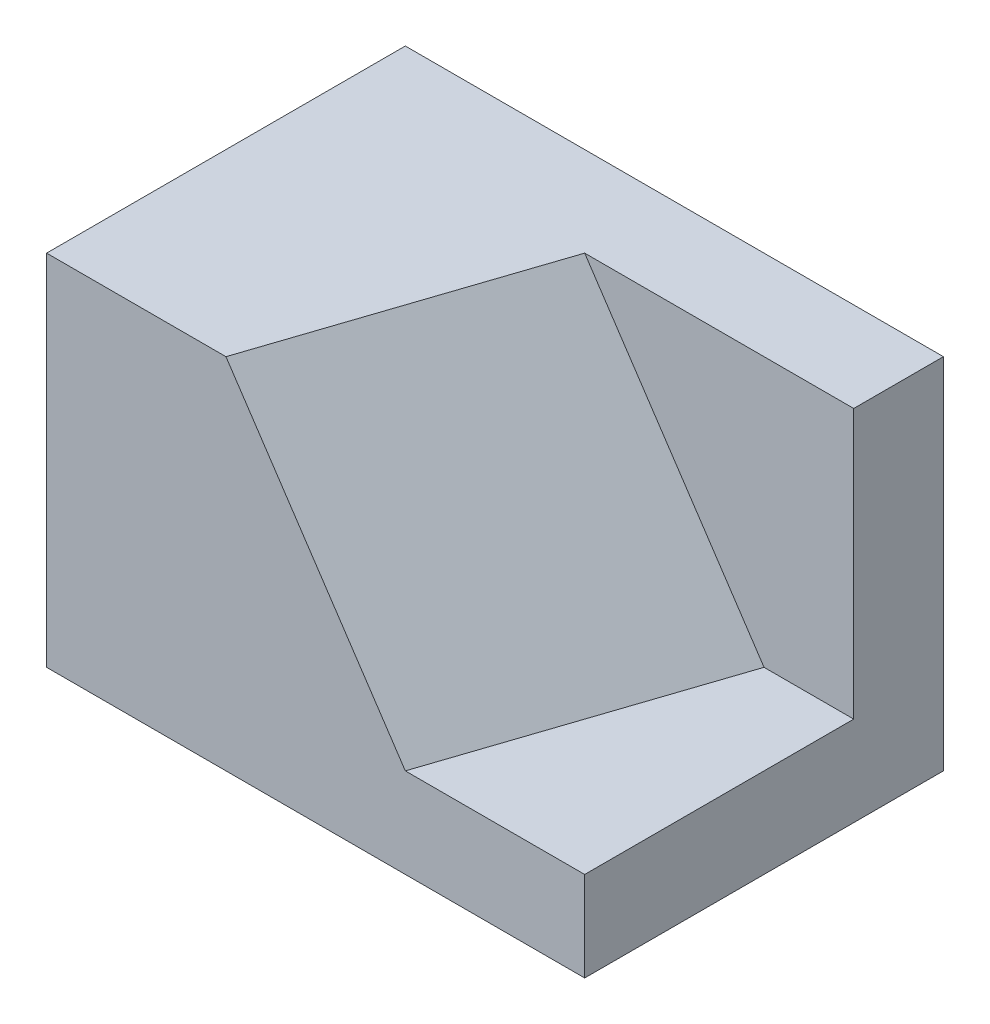
ISO-10303-21;
HEADER;
FILE_DESCRIPTION(('STEP AP214'),'2;1');
FILE_NAME('part.step','',(''),(''),'','','');
FILE_SCHEMA(('AUTOMOTIVE_DESIGN { 1 0 10303 214 1 1 1 1 }'));
ENDSEC;
DATA;
#1=APPLICATION_CONTEXT('core data for automotive mechanical design processes');
#2=APPLICATION_PROTOCOL_DEFINITION('international standard','automotive_design',2000,#1);
#3=PRODUCT_CONTEXT('',#1,'mechanical');
#4=PRODUCT('Part','Part','',(#3));
#5=PRODUCT_RELATED_PRODUCT_CATEGORY('part','',(#4));
#6=PRODUCT_DEFINITION_FORMATION('','',#4);
#7=PRODUCT_DEFINITION_CONTEXT('part definition',#1,'design');
#8=PRODUCT_DEFINITION('design','',#6,#7);
#9=PRODUCT_DEFINITION_SHAPE('','',#8);
#10=(LENGTH_UNIT() NAMED_UNIT(*) SI_UNIT(.MILLI.,.METRE.));
#11=(NAMED_UNIT(*) PLANE_ANGLE_UNIT() SI_UNIT($,.RADIAN.));
#12=(NAMED_UNIT(*) SI_UNIT($,.STERADIAN.) SOLID_ANGLE_UNIT());
#13=UNCERTAINTY_MEASURE_WITH_UNIT(LENGTH_MEASURE(1.E-05),#10,'distance_accuracy_value','');
#14=(GEOMETRIC_REPRESENTATION_CONTEXT(3) GLOBAL_UNCERTAINTY_ASSIGNED_CONTEXT((#13)) GLOBAL_UNIT_ASSIGNED_CONTEXT((#10,
#11,#12)) REPRESENTATION_CONTEXT('',''));
#15=CARTESIAN_POINT('',(0.,0.,0.));
#16=DIRECTION('',(0.,0.,1.));
#17=DIRECTION('',(1.,0.,0.));
#18=AXIS2_PLACEMENT_3D('',#15,#16,#17);
#19=CARTESIAN_POINT('',(-5.0408163265306,11.1428571428571,-2.73469387755102));
#20=DIRECTION('',(1.,0.,0.));
#21=DIRECTION('',(0.,0.,-1.));
#22=AXIS2_PLACEMENT_3D('',#19,#20,#21);
#23=PLANE('',#22);
#24=DIRECTION('',(0.,0.,1.));
#25=VECTOR('',#24,1.);
#26=CARTESIAN_POINT('',(-5.0408163265306,7.14285714285714,-2.73469387755102));
#27=LINE('',#26,#25);
#28=CARTESIAN_POINT('',(-5.0408163265306,7.14285714285714,-2.73469387755102));
#29=VERTEX_POINT('',#28);
#30=CARTESIAN_POINT('',(-5.0408163265306,7.14285714285714,1.26530612244898));
#31=VERTEX_POINT('',#30);
#32=EDGE_CURVE('E134',#29,#31,#27,.T.);
#33=ORIENTED_EDGE('',*,*,#32,.T.);
#34=DIRECTION('',(0.,-1.,0.));
#35=VECTOR('',#34,1.);
#36=CARTESIAN_POINT('',(-5.0408163265306,11.1428571428571,1.26530612244898));
#37=LINE('',#36,#35);
#38=CARTESIAN_POINT('',(-5.0408163265306,11.1428571428571,1.26530612244898));
#39=VERTEX_POINT('',#38);
#40=EDGE_CURVE('E11',#39,#31,#37,.T.);
#41=ORIENTED_EDGE('',*,*,#40,.F.);
#42=DIRECTION('',(0.,0.,1.));
#43=VECTOR('',#42,1.);
#44=CARTESIAN_POINT('',(-5.0408163265306,11.1428571428571,-2.73469387755102));
#45=LINE('',#44,#43);
#46=CARTESIAN_POINT('',(-5.0408163265306,11.1428571428571,-2.73469387755102));
#47=VERTEX_POINT('',#46);
#48=EDGE_CURVE('E127',#47,#39,#45,.T.);
#49=ORIENTED_EDGE('',*,*,#48,.F.);
#50=DIRECTION('',(0.,-1.,0.));
#51=VECTOR('',#50,1.);
#52=CARTESIAN_POINT('',(-5.0408163265306,11.1428571428571,-2.73469387755102));
#53=LINE('',#52,#51);
#54=EDGE_CURVE('E133',#47,#29,#53,.T.);
#55=ORIENTED_EDGE('',*,*,#54,.T.);
#56=EDGE_LOOP('',(#33,#41,#49,#55));
#57=FACE_BOUND('',#56,.T.);
#58=ADVANCED_FACE('F36',(#57),#23,.F.);
#59=CARTESIAN_POINT('',(0.959183673469398,11.1428571428571,1.26530612244898));
#60=DIRECTION('',(0.,0.,-1.));
#61=DIRECTION('',(-1.,0.,0.));
#62=AXIS2_PLACEMENT_3D('',#59,#60,#61);
#63=PLANE('',#62);
#64=DIRECTION('',(1.,0.,0.));
#65=VECTOR('',#64,1.);
#66=CARTESIAN_POINT('',(-6.30788798115484,8.14285714285714,1.26530612244898));
#67=LINE('',#66,#65);
#68=CARTESIAN_POINT('',(-1.0408163265306,8.14285714285714,1.26530612244898));
#69=VERTEX_POINT('',#68);
#70=CARTESIAN_POINT('',(0.959183673469398,8.14285714285714,1.26530612244898));
#71=VERTEX_POINT('',#70);
#72=EDGE_CURVE('E109',#69,#71,#67,.T.);
#73=ORIENTED_EDGE('',*,*,#72,.F.);
#74=DIRECTION('',(0.554700196225229,-0.832050294337844,0.));
#75=VECTOR('',#74,1.);
#76=CARTESIAN_POINT('',(-2.66145375872267,10.5738132911453,1.26530612244898));
#77=LINE('',#76,#75);
#78=CARTESIAN_POINT('',(-3.0408163265306,11.1428571428571,1.26530612244898));
#79=VERTEX_POINT('',#78);
#80=EDGE_CURVE('E115',#79,#69,#77,.T.);
#81=ORIENTED_EDGE('',*,*,#80,.F.);
#82=DIRECTION('',(1.,0.,0.));
#83=VECTOR('',#82,1.);
#84=CARTESIAN_POINT('',(0.959183673469398,11.1428571428571,1.26530612244898));
#85=LINE('',#84,#83);
#86=EDGE_CURVE('E85',#39,#79,#85,.T.);
#87=ORIENTED_EDGE('',*,*,#86,.F.);
#88=ORIENTED_EDGE('',*,*,#40,.T.);
#89=DIRECTION('',(1.,0.,0.));
#90=VECTOR('',#89,1.);
#91=CARTESIAN_POINT('',(0.959183673469398,7.14285714285714,1.26530612244898));
#92=LINE('',#91,#90);
#93=CARTESIAN_POINT('',(0.959183673469398,7.14285714285714,1.26530612244898));
#94=VERTEX_POINT('',#93);
#95=EDGE_CURVE('E137',#31,#94,#92,.T.);
#96=ORIENTED_EDGE('',*,*,#95,.T.);
#97=DIRECTION('',(0.,-1.,0.));
#98=VECTOR('',#97,1.);
#99=CARTESIAN_POINT('',(0.959183673469398,11.1428571428571,1.26530612244898));
#100=LINE('',#99,#98);
#101=EDGE_CURVE('E43',#71,#94,#100,.T.);
#102=ORIENTED_EDGE('',*,*,#101,.F.);
#103=EDGE_LOOP('',(#73,#81,#87,#88,#96,#102));
#104=FACE_BOUND('',#103,.T.);
#105=ADVANCED_FACE('F121',(#104),#63,.F.);
#106=CARTESIAN_POINT('',(0.959183673469397,11.1428571428571,-2.73469387755102));
#107=DIRECTION('',(-1.,0.,0.));
#108=DIRECTION('',(0.,0.,1.));
#109=AXIS2_PLACEMENT_3D('',#106,#107,#108);
#110=PLANE('',#109);
#111=DIRECTION('',(0.,1.,0.));
#112=VECTOR('',#111,1.);
#113=CARTESIAN_POINT('',(0.959183673469397,11.1428571428571,-1.73469387755102));
#114=LINE('',#113,#112);
#115=CARTESIAN_POINT('',(0.959183673469397,8.14285714285717,-1.73469387755102));
#116=VERTEX_POINT('',#115);
#117=CARTESIAN_POINT('',(0.959183673469397,11.1428571428571,-1.73469387755102));
#118=VERTEX_POINT('',#117);
#119=EDGE_CURVE('E50',#116,#118,#114,.T.);
#120=ORIENTED_EDGE('',*,*,#119,.F.);
#121=DIRECTION('',(0.,0.,-1.));
#122=VECTOR('',#121,1.);
#123=CARTESIAN_POINT('',(0.959183673469397,8.14285714285717,-1.73469387755102));
#124=LINE('',#123,#122);
#125=EDGE_CURVE('E148',#71,#116,#124,.T.);
#126=ORIENTED_EDGE('',*,*,#125,.F.);
#127=ORIENTED_EDGE('',*,*,#101,.T.);
#128=DIRECTION('',(0.,0.,-1.));
#129=VECTOR('',#128,1.);
#130=CARTESIAN_POINT('',(0.959183673469397,7.14285714285714,-2.73469387755102));
#131=LINE('',#130,#129);
#132=CARTESIAN_POINT('',(0.959183673469397,7.14285714285714,-2.73469387755102));
#133=VERTEX_POINT('',#132);
#134=EDGE_CURVE('E139',#94,#133,#131,.T.);
#135=ORIENTED_EDGE('',*,*,#134,.T.);
#136=DIRECTION('',(0.,-1.,0.));
#137=VECTOR('',#136,1.);
#138=CARTESIAN_POINT('',(0.959183673469397,11.1428571428571,-2.73469387755102));
#139=LINE('',#138,#137);
#140=CARTESIAN_POINT('',(0.959183673469397,11.1428571428571,-2.73469387755102));
#141=VERTEX_POINT('',#140);
#142=EDGE_CURVE('E143',#141,#133,#139,.T.);
#143=ORIENTED_EDGE('',*,*,#142,.F.);
#144=DIRECTION('',(0.,0.,-1.));
#145=VECTOR('',#144,1.);
#146=CARTESIAN_POINT('',(0.959183673469397,11.1428571428571,-2.73469387755102));
#147=LINE('',#146,#145);
#148=EDGE_CURVE('E130',#118,#141,#147,.T.);
#149=ORIENTED_EDGE('',*,*,#148,.F.);
#150=EDGE_LOOP('',(#120,#126,#127,#135,#143,#149));
#151=FACE_BOUND('',#150,.T.);
#152=ADVANCED_FACE('F145',(#151),#110,.F.);
#153=CARTESIAN_POINT('',(0.959183673469397,11.1428571428571,-2.73469387755102));
#154=DIRECTION('',(0.,0.,1.));
#155=DIRECTION('',(1.,0.,0.));
#156=AXIS2_PLACEMENT_3D('',#153,#154,#155);
#157=PLANE('',#156);
#158=DIRECTION('',(-1.,0.,0.));
#159=VECTOR('',#158,1.);
#160=CARTESIAN_POINT('',(0.959183673469397,7.14285714285714,-2.73469387755102));
#161=LINE('',#160,#159);
#162=EDGE_CURVE('E79',#133,#29,#161,.T.);
#163=ORIENTED_EDGE('',*,*,#162,.T.);
#164=ORIENTED_EDGE('',*,*,#54,.F.);
#165=DIRECTION('',(-1.,0.,0.));
#166=VECTOR('',#165,1.);
#167=CARTESIAN_POINT('',(0.959183673469397,11.1428571428571,-2.73469387755102));
#168=LINE('',#167,#166);
#169=EDGE_CURVE('E59',#141,#47,#168,.T.);
#170=ORIENTED_EDGE('',*,*,#169,.F.);
#171=ORIENTED_EDGE('',*,*,#142,.T.);
#172=EDGE_LOOP('',(#163,#164,#170,#171));
#173=FACE_BOUND('',#172,.T.);
#174=ADVANCED_FACE('F155',(#173),#157,.F.);
#175=CARTESIAN_POINT('',(-2.0408163265306,11.1428571428571,-0.73469387755102));
#176=DIRECTION('',(0.,-1.,0.));
#177=DIRECTION('',(0.,0.,-1.));
#178=AXIS2_PLACEMENT_3D('',#175,#176,#177);
#179=PLANE('',#178);
#180=ORIENTED_EDGE('',*,*,#86,.T.);
#181=DIRECTION('',(-0.316227766016838,0.,0.948683298050514));
#182=VECTOR('',#181,1.);
#183=CARTESIAN_POINT('',(-3.36752349199303,11.1428571428571,2.24542761883625));
#184=LINE('',#183,#182);
#185=CARTESIAN_POINT('',(-2.0408163265306,11.1428571428571,-1.73469387755102));
#186=VERTEX_POINT('',#185);
#187=EDGE_CURVE('E118',#186,#79,#184,.T.);
#188=ORIENTED_EDGE('',*,*,#187,.F.);
#189=DIRECTION('',(1.,0.,0.));
#190=VECTOR('',#189,1.);
#191=CARTESIAN_POINT('',(-6.30788798115484,11.1428571428571,-1.73469387755102));
#192=LINE('',#191,#190);
#193=EDGE_CURVE('E158',#186,#118,#192,.T.);
#194=ORIENTED_EDGE('',*,*,#193,.T.);
#195=ORIENTED_EDGE('',*,*,#148,.T.);
#196=ORIENTED_EDGE('',*,*,#169,.T.);
#197=ORIENTED_EDGE('',*,*,#48,.T.);
#198=EDGE_LOOP('',(#180,#188,#194,#195,#196,#197));
#199=FACE_BOUND('',#198,.T.);
#200=ADVANCED_FACE('F157',(#199),#179,.F.);
#201=CARTESIAN_POINT('',(-2.0408163265306,7.14285714285714,-0.73469387755102));
#202=DIRECTION('',(0.,-1.,0.));
#203=DIRECTION('',(0.,0.,-1.));
#204=AXIS2_PLACEMENT_3D('',#201,#202,#203);
#205=PLANE('',#204);
#206=ORIENTED_EDGE('',*,*,#32,.F.);
#207=ORIENTED_EDGE('',*,*,#162,.F.);
#208=ORIENTED_EDGE('',*,*,#134,.F.);
#209=ORIENTED_EDGE('',*,*,#95,.F.);
#210=EDGE_LOOP('',(#206,#207,#208,#209));
#211=FACE_BOUND('',#210,.T.);
#212=ADVANCED_FACE('F152',(#211),#205,.T.);
#213=CARTESIAN_POINT('',(-0.540816326530603,8.14285714285714,-0.23469387755102));
#214=DIRECTION('',(-0.801783725737273,-0.534522483824849,-0.267261241912424));
#215=DIRECTION('',(0.554700196225229,-0.832050294337844,0.));
#216=AXIS2_PLACEMENT_3D('',#213,#214,#215);
#217=PLANE('',#216);
#218=ORIENTED_EDGE('',*,*,#187,.T.);
#219=ORIENTED_EDGE('',*,*,#80,.T.);
#220=DIRECTION('',(0.316227766016834,0.,-0.948683298050515));
#221=VECTOR('',#220,1.);
#222=CARTESIAN_POINT('',(-0.667523491993022,8.14285714285715,0.145427618836224));
#223=LINE('',#222,#221);
#224=CARTESIAN_POINT('',(-0.0408163265306166,8.14285714285717,-1.73469387755102));
#225=VERTEX_POINT('',#224);
#226=EDGE_CURVE('E104',#69,#225,#223,.T.);
#227=ORIENTED_EDGE('',*,*,#226,.T.);
#228=DIRECTION('',(-0.554700196225229,0.832050294337844,0.));
#229=VECTOR('',#228,1.);
#230=CARTESIAN_POINT('',(-3.35376145103037,13.1122748296068,-1.73469387755102));
#231=LINE('',#230,#229);
#232=EDGE_CURVE('E159',#225,#186,#231,.T.);
#233=ORIENTED_EDGE('',*,*,#232,.T.);
#234=EDGE_LOOP('',(#218,#219,#227,#233));
#235=FACE_BOUND('',#234,.T.);
#236=ADVANCED_FACE('F116',(#235),#217,.F.);
#237=CARTESIAN_POINT('',(-6.30788798115484,8.14285714285717,-1.73469387755102));
#238=DIRECTION('',(0.,-1.,0.));
#239=DIRECTION('',(0.,0.,-1.));
#240=AXIS2_PLACEMENT_3D('',#237,#238,#239);
#241=PLANE('',#240);
#242=ORIENTED_EDGE('',*,*,#72,.T.);
#243=ORIENTED_EDGE('',*,*,#125,.T.);
#244=DIRECTION('',(1.,0.,0.));
#245=VECTOR('',#244,1.);
#246=CARTESIAN_POINT('',(-6.30788798115484,8.14285714285717,-1.73469387755102));
#247=LINE('',#246,#245);
#248=EDGE_CURVE('E111',#225,#116,#247,.T.);
#249=ORIENTED_EDGE('',*,*,#248,.F.);
#250=ORIENTED_EDGE('',*,*,#226,.F.);
#251=EDGE_LOOP('',(#242,#243,#249,#250));
#252=FACE_BOUND('',#251,.T.);
#253=ADVANCED_FACE('F106',(#252),#241,.F.);
#254=CARTESIAN_POINT('',(-6.30788798115484,11.1428571428571,-1.73469387755102));
#255=DIRECTION('',(0.,0.,-1.));
#256=DIRECTION('',(-1.,0.,0.));
#257=AXIS2_PLACEMENT_3D('',#254,#255,#256);
#258=PLANE('',#257);
#259=ORIENTED_EDGE('',*,*,#248,.T.);
#260=ORIENTED_EDGE('',*,*,#119,.T.);
#261=ORIENTED_EDGE('',*,*,#193,.F.);
#262=ORIENTED_EDGE('',*,*,#232,.F.);
#263=EDGE_LOOP('',(#259,#260,#261,#262));
#264=FACE_BOUND('',#263,.T.);
#265=ADVANCED_FACE('F164',(#264),#258,.F.);
#266=CLOSED_SHELL('',(#58,#105,#152,#174,#200,#212,#236,#253,#265));
#267=MANIFOLD_SOLID_BREP('B2',#266);
#268=ADVANCED_BREP_SHAPE_REPRESENTATION('',(#18,#267),#14);
#269=SHAPE_DEFINITION_REPRESENTATION(#9,#268);
ENDSEC;
END-ISO-10303-21;
